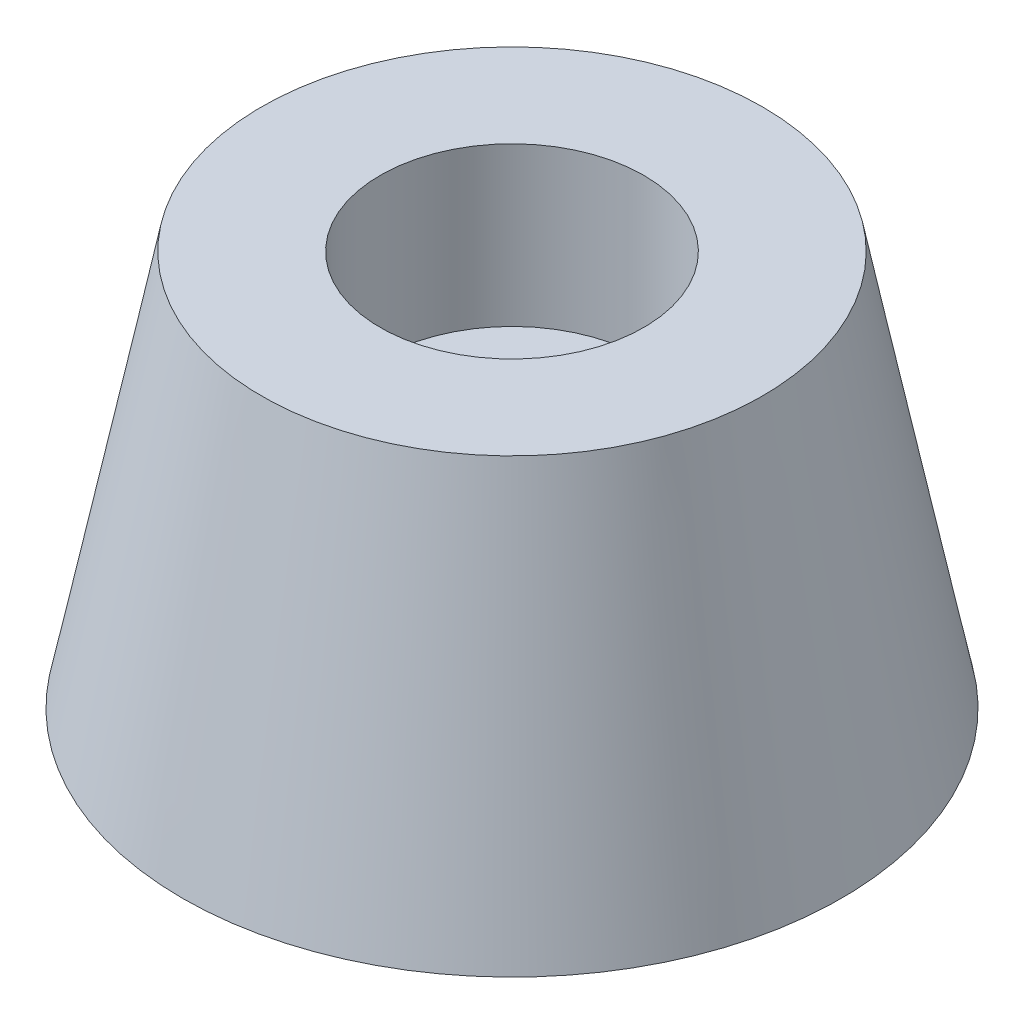
ISO-10303-21;
HEADER;
FILE_DESCRIPTION(('STEP AP214'),'2;1');
FILE_NAME('part.step','',(''),(''),'','','');
FILE_SCHEMA(('AUTOMOTIVE_DESIGN { 1 0 10303 214 1 1 1 1 }'));
ENDSEC;
DATA;
#1=APPLICATION_CONTEXT('core data for automotive mechanical design processes');
#2=APPLICATION_PROTOCOL_DEFINITION('international standard','automotive_design',2000,#1);
#3=PRODUCT_CONTEXT('',#1,'mechanical');
#4=PRODUCT('Part','Part','',(#3));
#5=PRODUCT_RELATED_PRODUCT_CATEGORY('part','',(#4));
#6=PRODUCT_DEFINITION_FORMATION('','',#4);
#7=PRODUCT_DEFINITION_CONTEXT('part definition',#1,'design');
#8=PRODUCT_DEFINITION('design','',#6,#7);
#9=PRODUCT_DEFINITION_SHAPE('','',#8);
#10=(LENGTH_UNIT() NAMED_UNIT(*) SI_UNIT(.MILLI.,.METRE.));
#11=(NAMED_UNIT(*) PLANE_ANGLE_UNIT() SI_UNIT($,.RADIAN.));
#12=(NAMED_UNIT(*) SI_UNIT($,.STERADIAN.) SOLID_ANGLE_UNIT());
#13=UNCERTAINTY_MEASURE_WITH_UNIT(LENGTH_MEASURE(1.E-05),#10,'distance_accuracy_value','');
#14=(GEOMETRIC_REPRESENTATION_CONTEXT(3) GLOBAL_UNCERTAINTY_ASSIGNED_CONTEXT((#13)) GLOBAL_UNIT_ASSIGNED_CONTEXT((#10,
#11,#12)) REPRESENTATION_CONTEXT('',''));
#15=CARTESIAN_POINT('',(0.,0.,0.));
#16=DIRECTION('',(0.,0.,1.));
#17=DIRECTION('',(1.,0.,0.));
#18=AXIS2_PLACEMENT_3D('',#15,#16,#17);
#19=CARTESIAN_POINT('',(-5.,15.,0.));
#20=DIRECTION('',(0.,-1.,0.));
#21=DIRECTION('',(0.,0.,-1.));
#22=AXIS2_PLACEMENT_3D('',#19,#20,#21);
#23=PLANE('',#22);
#24=CARTESIAN_POINT('',(0.,15.,0.));
#25=DIRECTION('',(0.,-1.,0.));
#26=DIRECTION('',(0.,0.,-1.));
#27=AXIS2_PLACEMENT_3D('',#24,#25,#26);
#28=CIRCLE('',#27,9.5);
#29=CARTESIAN_POINT('',(0.,15.,-9.5));
#30=VERTEX_POINT('',#29);
#31=EDGE_CURVE('E55',#30,#30,#28,.T.);
#32=ORIENTED_EDGE('',*,*,#31,.F.);
#33=EDGE_LOOP('',(#32));
#34=FACE_BOUND('',#33,.T.);
#35=CARTESIAN_POINT('',(0.,15.,0.));
#36=DIRECTION('',(0.,-1.,0.));
#37=DIRECTION('',(0.,0.,-1.));
#38=AXIS2_PLACEMENT_3D('',#35,#36,#37);
#39=CIRCLE('',#38,5.);
#40=CARTESIAN_POINT('',(0.,15.,-5.));
#41=VERTEX_POINT('',#40);
#42=EDGE_CURVE('E10',#41,#41,#39,.T.);
#43=ORIENTED_EDGE('',*,*,#42,.T.);
#44=EDGE_LOOP('',(#43));
#45=FACE_BOUND('',#44,.T.);
#46=ADVANCED_FACE('F33',(#34,#45),#23,.F.);
#47=CARTESIAN_POINT('',(0.,0.,0.));
#48=DIRECTION('',(0.,-1.,0.));
#49=DIRECTION('',(0.,0.,-1.));
#50=AXIS2_PLACEMENT_3D('',#47,#48,#49);
#51=CYLINDRICAL_SURFACE('',#50,5.);
#52=ORIENTED_EDGE('',*,*,#42,.F.);
#53=EDGE_LOOP('',(#52));
#54=FACE_BOUND('',#53,.T.);
#55=CARTESIAN_POINT('',(0.,9.,0.));
#56=DIRECTION('',(0.,-1.,0.));
#57=DIRECTION('',(0.,0.,-1.));
#58=AXIS2_PLACEMENT_3D('',#55,#56,#57);
#59=CIRCLE('',#58,5.);
#60=CARTESIAN_POINT('',(0.,9.,-5.));
#61=VERTEX_POINT('',#60);
#62=EDGE_CURVE('E39',#61,#61,#59,.T.);
#63=ORIENTED_EDGE('',*,*,#62,.T.);
#64=EDGE_LOOP('',(#63));
#65=FACE_BOUND('',#64,.T.);
#66=ADVANCED_FACE('F62',(#54,#65),#51,.F.);
#67=CARTESIAN_POINT('',(-2.5,9.,0.));
#68=DIRECTION('',(0.,-1.,0.));
#69=DIRECTION('',(0.,0.,-1.));
#70=AXIS2_PLACEMENT_3D('',#67,#68,#69);
#71=PLANE('',#70);
#72=ORIENTED_EDGE('',*,*,#62,.F.);
#73=EDGE_LOOP('',(#72));
#74=FACE_BOUND('',#73,.T.);
#75=CARTESIAN_POINT('',(0.,9.,0.));
#76=DIRECTION('',(0.,-1.,0.));
#77=DIRECTION('',(0.,0.,-1.));
#78=AXIS2_PLACEMENT_3D('',#75,#76,#77);
#79=CIRCLE('',#78,2.5);
#80=CARTESIAN_POINT('',(0.,9.,-2.5));
#81=VERTEX_POINT('',#80);
#82=EDGE_CURVE('E43',#81,#81,#79,.T.);
#83=ORIENTED_EDGE('',*,*,#82,.T.);
#84=EDGE_LOOP('',(#83));
#85=FACE_BOUND('',#84,.T.);
#86=ADVANCED_FACE('F66',(#74,#85),#71,.F.);
#87=CARTESIAN_POINT('',(0.,0.,0.));
#88=DIRECTION('',(0.,-1.,0.));
#89=DIRECTION('',(0.,0.,-1.));
#90=AXIS2_PLACEMENT_3D('',#87,#88,#89);
#91=CYLINDRICAL_SURFACE('',#90,2.5);
#92=ORIENTED_EDGE('',*,*,#82,.F.);
#93=EDGE_LOOP('',(#92));
#94=FACE_BOUND('',#93,.T.);
#95=CARTESIAN_POINT('',(0.,0.,0.));
#96=DIRECTION('',(0.,-1.,0.));
#97=DIRECTION('',(0.,0.,-1.));
#98=AXIS2_PLACEMENT_3D('',#95,#96,#97);
#99=CIRCLE('',#98,2.5);
#100=CARTESIAN_POINT('',(0.,0.,-2.5));
#101=VERTEX_POINT('',#100);
#102=EDGE_CURVE('E47',#101,#101,#99,.T.);
#103=ORIENTED_EDGE('',*,*,#102,.T.);
#104=EDGE_LOOP('',(#103));
#105=FACE_BOUND('',#104,.T.);
#106=ADVANCED_FACE('F71',(#94,#105),#91,.F.);
#107=CARTESIAN_POINT('',(-12.5,0.,0.));
#108=DIRECTION('',(0.,1.,0.));
#109=DIRECTION('',(0.,0.,1.));
#110=AXIS2_PLACEMENT_3D('',#107,#108,#109);
#111=PLANE('',#110);
#112=ORIENTED_EDGE('',*,*,#102,.F.);
#113=EDGE_LOOP('',(#112));
#114=FACE_BOUND('',#113,.T.);
#115=CARTESIAN_POINT('',(0.,0.,0.));
#116=DIRECTION('',(0.,-1.,0.));
#117=DIRECTION('',(0.,0.,-1.));
#118=AXIS2_PLACEMENT_3D('',#115,#116,#117);
#119=CIRCLE('',#118,12.5);
#120=CARTESIAN_POINT('',(0.,0.,-12.5));
#121=VERTEX_POINT('',#120);
#122=EDGE_CURVE('E52',#121,#121,#119,.T.);
#123=ORIENTED_EDGE('',*,*,#122,.T.);
#124=EDGE_LOOP('',(#123));
#125=FACE_BOUND('',#124,.T.);
#126=ADVANCED_FACE('F77',(#114,#125),#111,.F.);
#127=CARTESIAN_POINT('',(0.,15.,0.));
#128=DIRECTION('',(0.,-1.,0.));
#129=DIRECTION('',(0.,0.,-1.));
#130=AXIS2_PLACEMENT_3D('',#127,#128,#129);
#131=CONICAL_SURFACE('',#130,9.5,0.197395559849881);
#132=ORIENTED_EDGE('',*,*,#122,.F.);
#133=EDGE_LOOP('',(#132));
#134=FACE_BOUND('',#133,.T.);
#135=ORIENTED_EDGE('',*,*,#31,.T.);
#136=EDGE_LOOP('',(#135));
#137=FACE_BOUND('',#136,.T.);
#138=ADVANCED_FACE('F59',(#134,#137),#131,.T.);
#139=CLOSED_SHELL('',(#46,#66,#86,#106,#126,#138));
#140=MANIFOLD_SOLID_BREP('B2',#139);
#141=ADVANCED_BREP_SHAPE_REPRESENTATION('',(#18,#140),#14);
#142=SHAPE_DEFINITION_REPRESENTATION(#9,#141);
ENDSEC;
END-ISO-10303-21;
